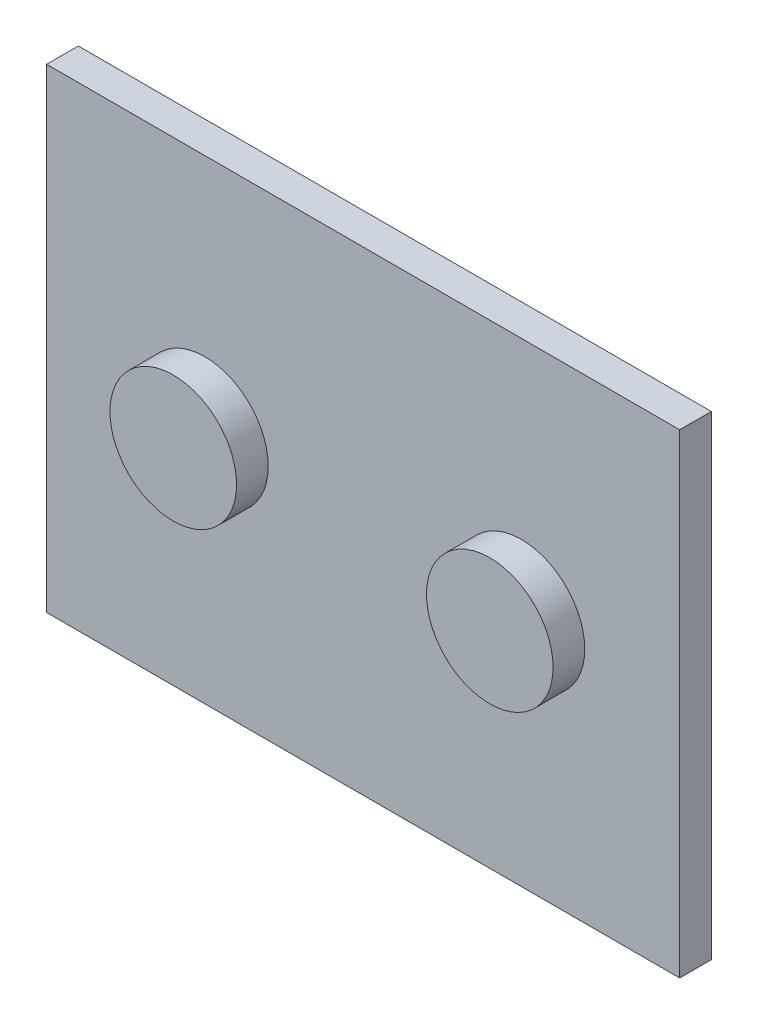
ISO-10303-21;
HEADER;
FILE_DESCRIPTION(('STEP AP214'),'2;1');
FILE_NAME('part.step','',(''),(''),'','','');
FILE_SCHEMA(('AUTOMOTIVE_DESIGN { 1 0 10303 214 1 1 1 1 }'));
ENDSEC;
DATA;
#1=APPLICATION_CONTEXT('core data for automotive mechanical design processes');
#2=APPLICATION_PROTOCOL_DEFINITION('international standard','automotive_design',2000,#1);
#3=PRODUCT_CONTEXT('',#1,'mechanical');
#4=PRODUCT('Part','Part','',(#3));
#5=PRODUCT_RELATED_PRODUCT_CATEGORY('part','',(#4));
#6=PRODUCT_DEFINITION_FORMATION('','',#4);
#7=PRODUCT_DEFINITION_CONTEXT('part definition',#1,'design');
#8=PRODUCT_DEFINITION('design','',#6,#7);
#9=PRODUCT_DEFINITION_SHAPE('','',#8);
#10=(LENGTH_UNIT() NAMED_UNIT(*) SI_UNIT(.MILLI.,.METRE.));
#11=(NAMED_UNIT(*) PLANE_ANGLE_UNIT() SI_UNIT($,.RADIAN.));
#12=(NAMED_UNIT(*) SI_UNIT($,.STERADIAN.) SOLID_ANGLE_UNIT());
#13=UNCERTAINTY_MEASURE_WITH_UNIT(LENGTH_MEASURE(1.E-05),#10,'distance_accuracy_value','');
#14=(GEOMETRIC_REPRESENTATION_CONTEXT(3) GLOBAL_UNCERTAINTY_ASSIGNED_CONTEXT((#13)) GLOBAL_UNIT_ASSIGNED_CONTEXT((#10,
#11,#12)) REPRESENTATION_CONTEXT('',''));
#15=CARTESIAN_POINT('',(0.,0.,0.));
#16=DIRECTION('',(0.,0.,1.));
#17=DIRECTION('',(1.,0.,0.));
#18=AXIS2_PLACEMENT_3D('',#15,#16,#17);
#19=CARTESIAN_POINT('',(-101.369011051125,69.9690946331645,10.));
#20=DIRECTION('',(1.,0.,0.));
#21=DIRECTION('',(0.,0.,-1.));
#22=AXIS2_PLACEMENT_3D('',#19,#20,#21);
#23=PLANE('',#22);
#24=DIRECTION('',(0.,-1.,0.));
#25=VECTOR('',#24,1.);
#26=CARTESIAN_POINT('',(-101.369011051125,69.9690946331645,0.));
#27=LINE('',#26,#25);
#28=CARTESIAN_POINT('',(-101.369011051125,69.9690946331645,0.));
#29=VERTEX_POINT('',#28);
#30=CARTESIAN_POINT('',(-101.369011051125,-80.0309053668355,0.));
#31=VERTEX_POINT('',#30);
#32=EDGE_CURVE('E103',#29,#31,#27,.T.);
#33=ORIENTED_EDGE('',*,*,#32,.T.);
#34=DIRECTION('',(0.,0.,-1.));
#35=VECTOR('',#34,1.);
#36=CARTESIAN_POINT('',(-101.369011051125,-80.0309053668355,10.));
#37=LINE('',#36,#35);
#38=CARTESIAN_POINT('',(-101.369011051125,-80.0309053668355,10.));
#39=VERTEX_POINT('',#38);
#40=EDGE_CURVE('E11',#39,#31,#37,.T.);
#41=ORIENTED_EDGE('',*,*,#40,.F.);
#42=DIRECTION('',(0.,-1.,0.));
#43=VECTOR('',#42,1.);
#44=CARTESIAN_POINT('',(-101.369011051125,69.9690946331645,10.));
#45=LINE('',#44,#43);
#46=CARTESIAN_POINT('',(-101.369011051125,69.9690946331645,10.));
#47=VERTEX_POINT('',#46);
#48=EDGE_CURVE('E91',#47,#39,#45,.T.);
#49=ORIENTED_EDGE('',*,*,#48,.F.);
#50=DIRECTION('',(0.,0.,-1.));
#51=VECTOR('',#50,1.);
#52=CARTESIAN_POINT('',(-101.369011051125,69.9690946331645,10.));
#53=LINE('',#52,#51);
#54=EDGE_CURVE('E99',#47,#29,#53,.T.);
#55=ORIENTED_EDGE('',*,*,#54,.T.);
#56=EDGE_LOOP('',(#33,#41,#49,#55));
#57=FACE_BOUND('',#56,.T.);
#58=ADVANCED_FACE('F40',(#57),#23,.F.);
#59=CARTESIAN_POINT('',(-101.369011051125,-80.0309053668355,10.));
#60=DIRECTION('',(0.,1.,0.));
#61=DIRECTION('',(0.,0.,1.));
#62=AXIS2_PLACEMENT_3D('',#59,#60,#61);
#63=PLANE('',#62);
#64=DIRECTION('',(1.,0.,0.));
#65=VECTOR('',#64,1.);
#66=CARTESIAN_POINT('',(-101.369011051125,-80.0309053668355,0.));
#67=LINE('',#66,#65);
#68=CARTESIAN_POINT('',(98.6309889488754,-80.0309053668355,0.));
#69=VERTEX_POINT('',#68);
#70=EDGE_CURVE('E95',#31,#69,#67,.T.);
#71=ORIENTED_EDGE('',*,*,#70,.T.);
#72=DIRECTION('',(0.,0.,-1.));
#73=VECTOR('',#72,1.);
#74=CARTESIAN_POINT('',(98.6309889488754,-80.0309053668355,10.));
#75=LINE('',#74,#73);
#76=CARTESIAN_POINT('',(98.6309889488754,-80.0309053668355,10.));
#77=VERTEX_POINT('',#76);
#78=EDGE_CURVE('E48',#77,#69,#75,.T.);
#79=ORIENTED_EDGE('',*,*,#78,.F.);
#80=DIRECTION('',(1.,0.,0.));
#81=VECTOR('',#80,1.);
#82=CARTESIAN_POINT('',(-101.369011051125,-80.0309053668355,10.));
#83=LINE('',#82,#81);
#84=EDGE_CURVE('E86',#39,#77,#83,.T.);
#85=ORIENTED_EDGE('',*,*,#84,.F.);
#86=ORIENTED_EDGE('',*,*,#40,.T.);
#87=EDGE_LOOP('',(#71,#79,#85,#86));
#88=FACE_BOUND('',#87,.T.);
#89=ADVANCED_FACE('F94',(#88),#63,.F.);
#90=CARTESIAN_POINT('',(98.6309889488754,69.9690946331645,10.));
#91=DIRECTION('',(-1.,0.,0.));
#92=DIRECTION('',(0.,-1.,0.));
#93=AXIS2_PLACEMENT_3D('',#90,#91,#92);
#94=PLANE('',#93);
#95=DIRECTION('',(0.,1.,0.));
#96=VECTOR('',#95,1.);
#97=CARTESIAN_POINT('',(98.6309889488754,69.9690946331645,0.));
#98=LINE('',#97,#96);
#99=CARTESIAN_POINT('',(98.6309889488754,69.9690946331645,0.));
#100=VERTEX_POINT('',#99);
#101=EDGE_CURVE('E73',#69,#100,#98,.T.);
#102=ORIENTED_EDGE('',*,*,#101,.T.);
#103=DIRECTION('',(0.,0.,-1.));
#104=VECTOR('',#103,1.);
#105=CARTESIAN_POINT('',(98.6309889488754,69.9690946331645,10.));
#106=LINE('',#105,#104);
#107=CARTESIAN_POINT('',(98.6309889488754,69.9690946331645,10.));
#108=VERTEX_POINT('',#107);
#109=EDGE_CURVE('E96',#108,#100,#106,.T.);
#110=ORIENTED_EDGE('',*,*,#109,.F.);
#111=DIRECTION('',(0.,1.,0.));
#112=VECTOR('',#111,1.);
#113=CARTESIAN_POINT('',(98.6309889488754,69.9690946331645,10.));
#114=LINE('',#113,#112);
#115=EDGE_CURVE('E89',#77,#108,#114,.T.);
#116=ORIENTED_EDGE('',*,*,#115,.F.);
#117=ORIENTED_EDGE('',*,*,#78,.T.);
#118=EDGE_LOOP('',(#102,#110,#116,#117));
#119=FACE_BOUND('',#118,.T.);
#120=ADVANCED_FACE('F97',(#119),#94,.F.);
#121=CARTESIAN_POINT('',(-101.369011051125,69.9690946331645,10.));
#122=DIRECTION('',(0.,-1.,0.));
#123=DIRECTION('',(0.,0.,-1.));
#124=AXIS2_PLACEMENT_3D('',#121,#122,#123);
#125=PLANE('',#124);
#126=DIRECTION('',(-1.,0.,0.));
#127=VECTOR('',#126,1.);
#128=CARTESIAN_POINT('',(-101.369011051125,69.9690946331645,0.));
#129=LINE('',#128,#127);
#130=EDGE_CURVE('E79',#100,#29,#129,.T.);
#131=ORIENTED_EDGE('',*,*,#130,.T.);
#132=ORIENTED_EDGE('',*,*,#54,.F.);
#133=DIRECTION('',(-1.,0.,0.));
#134=VECTOR('',#133,1.);
#135=CARTESIAN_POINT('',(-101.369011051125,69.9690946331645,10.));
#136=LINE('',#135,#134);
#137=EDGE_CURVE('E56',#108,#47,#136,.T.);
#138=ORIENTED_EDGE('',*,*,#137,.F.);
#139=ORIENTED_EDGE('',*,*,#109,.T.);
#140=EDGE_LOOP('',(#131,#132,#138,#139));
#141=FACE_BOUND('',#140,.T.);
#142=ADVANCED_FACE('F111',(#141),#125,.F.);
#143=CARTESIAN_POINT('',(0.,0.,10.));
#144=DIRECTION('',(0.,0.,1.));
#145=DIRECTION('',(1.,0.,0.));
#146=AXIS2_PLACEMENT_3D('',#143,#144,#145);
#147=PLANE('',#146);
#148=CARTESIAN_POINT('',(-51.3690110511246,-5.03090536683552,10.));
#149=DIRECTION('',(0.,0.,1.));
#150=DIRECTION('',(1.,0.,0.));
#151=AXIS2_PLACEMENT_3D('',#148,#149,#150);
#152=CIRCLE('',#151,20.);
#153=CARTESIAN_POINT('',(-31.3690110511246,-5.03090536683552,10.));
#154=VERTEX_POINT('',#153);
#155=EDGE_CURVE('E120',#154,#154,#152,.T.);
#156=ORIENTED_EDGE('',*,*,#155,.F.);
#157=EDGE_LOOP('',(#156));
#158=FACE_BOUND('',#157,.T.);
#159=CARTESIAN_POINT('',(48.6309889488754,-5.03090536683552,10.));
#160=DIRECTION('',(0.,0.,1.));
#161=DIRECTION('',(1.,0.,0.));
#162=AXIS2_PLACEMENT_3D('',#159,#160,#161);
#163=CIRCLE('',#162,20.);
#164=CARTESIAN_POINT('',(68.6309889488754,-5.03090536683552,10.));
#165=VERTEX_POINT('',#164);
#166=EDGE_CURVE('E117',#165,#165,#163,.T.);
#167=ORIENTED_EDGE('',*,*,#166,.F.);
#168=EDGE_LOOP('',(#167));
#169=FACE_BOUND('',#168,.T.);
#170=ORIENTED_EDGE('',*,*,#48,.T.);
#171=ORIENTED_EDGE('',*,*,#84,.T.);
#172=ORIENTED_EDGE('',*,*,#115,.T.);
#173=ORIENTED_EDGE('',*,*,#137,.T.);
#174=EDGE_LOOP('',(#170,#171,#172,#173));
#175=FACE_BOUND('',#174,.T.);
#176=ADVANCED_FACE('F87',(#158,#169,#175),#147,.T.);
#177=CARTESIAN_POINT('',(0.,0.,0.));
#178=DIRECTION('',(0.,0.,1.));
#179=DIRECTION('',(1.,0.,0.));
#180=AXIS2_PLACEMENT_3D('',#177,#178,#179);
#181=PLANE('',#180);
#182=ORIENTED_EDGE('',*,*,#32,.F.);
#183=ORIENTED_EDGE('',*,*,#130,.F.);
#184=ORIENTED_EDGE('',*,*,#101,.F.);
#185=ORIENTED_EDGE('',*,*,#70,.F.);
#186=EDGE_LOOP('',(#182,#183,#184,#185));
#187=FACE_BOUND('',#186,.T.);
#188=ADVANCED_FACE('F114',(#187),#181,.F.);
#189=CARTESIAN_POINT('',(48.6309889488754,-5.03090536683552,20.));
#190=DIRECTION('',(0.,0.,-1.));
#191=DIRECTION('',(-1.,0.,0.));
#192=AXIS2_PLACEMENT_3D('',#189,#190,#191);
#193=CYLINDRICAL_SURFACE('',#192,20.);
#194=CARTESIAN_POINT('',(48.6309889488754,-5.03090536683552,20.));
#195=DIRECTION('',(0.,0.,1.));
#196=DIRECTION('',(1.,0.,0.));
#197=AXIS2_PLACEMENT_3D('',#194,#195,#196);
#198=CIRCLE('',#197,20.);
#199=CARTESIAN_POINT('',(68.6309889488754,-5.03090536683552,20.));
#200=VERTEX_POINT('',#199);
#201=EDGE_CURVE('E106',#200,#200,#198,.T.);
#202=ORIENTED_EDGE('',*,*,#201,.F.);
#203=EDGE_LOOP('',(#202));
#204=FACE_BOUND('',#203,.T.);
#205=ORIENTED_EDGE('',*,*,#166,.T.);
#206=EDGE_LOOP('',(#205));
#207=FACE_BOUND('',#206,.T.);
#208=ADVANCED_FACE('F136',(#204,#207),#193,.T.);
#209=CARTESIAN_POINT('',(0.,0.,20.));
#210=DIRECTION('',(0.,0.,1.));
#211=DIRECTION('',(1.,0.,0.));
#212=AXIS2_PLACEMENT_3D('',#209,#210,#211);
#213=PLANE('',#212);
#214=ORIENTED_EDGE('',*,*,#201,.T.);
#215=EDGE_LOOP('',(#214));
#216=FACE_BOUND('',#215,.T.);
#217=ADVANCED_FACE('F138',(#216),#213,.T.);
#218=CARTESIAN_POINT('',(-51.3690110511246,-5.03090536683552,20.));
#219=DIRECTION('',(0.,0.,-1.));
#220=DIRECTION('',(-1.,0.,0.));
#221=AXIS2_PLACEMENT_3D('',#218,#219,#220);
#222=CYLINDRICAL_SURFACE('',#221,20.);
#223=CARTESIAN_POINT('',(-51.3690110511246,-5.03090536683552,20.));
#224=DIRECTION('',(0.,0.,1.));
#225=DIRECTION('',(1.,0.,0.));
#226=AXIS2_PLACEMENT_3D('',#223,#224,#225);
#227=CIRCLE('',#226,20.);
#228=CARTESIAN_POINT('',(-31.3690110511246,-5.03090536683552,20.));
#229=VERTEX_POINT('',#228);
#230=EDGE_CURVE('E123',#229,#229,#227,.T.);
#231=ORIENTED_EDGE('',*,*,#230,.F.);
#232=EDGE_LOOP('',(#231));
#233=FACE_BOUND('',#232,.T.);
#234=ORIENTED_EDGE('',*,*,#155,.T.);
#235=EDGE_LOOP('',(#234));
#236=FACE_BOUND('',#235,.T.);
#237=ADVANCED_FACE('F129',(#233,#236),#222,.T.);
#238=CARTESIAN_POINT('',(-51.3690110511246,-5.03090536683552,20.));
#239=DIRECTION('',(0.,0.,1.));
#240=DIRECTION('',(1.,0.,0.));
#241=AXIS2_PLACEMENT_3D('',#238,#239,#240);
#242=PLANE('',#241);
#243=ORIENTED_EDGE('',*,*,#230,.T.);
#244=EDGE_LOOP('',(#243));
#245=FACE_BOUND('',#244,.T.);
#246=ADVANCED_FACE('F199',(#245),#242,.T.);
#247=CLOSED_SHELL('',(#58,#89,#120,#142,#176,#188,#208,#217,#237,#246));
#248=MANIFOLD_SOLID_BREP('B2',#247);
#249=ADVANCED_BREP_SHAPE_REPRESENTATION('',(#18,#248),#14);
#250=SHAPE_DEFINITION_REPRESENTATION(#9,#249);
ENDSEC;
END-ISO-10303-21;
